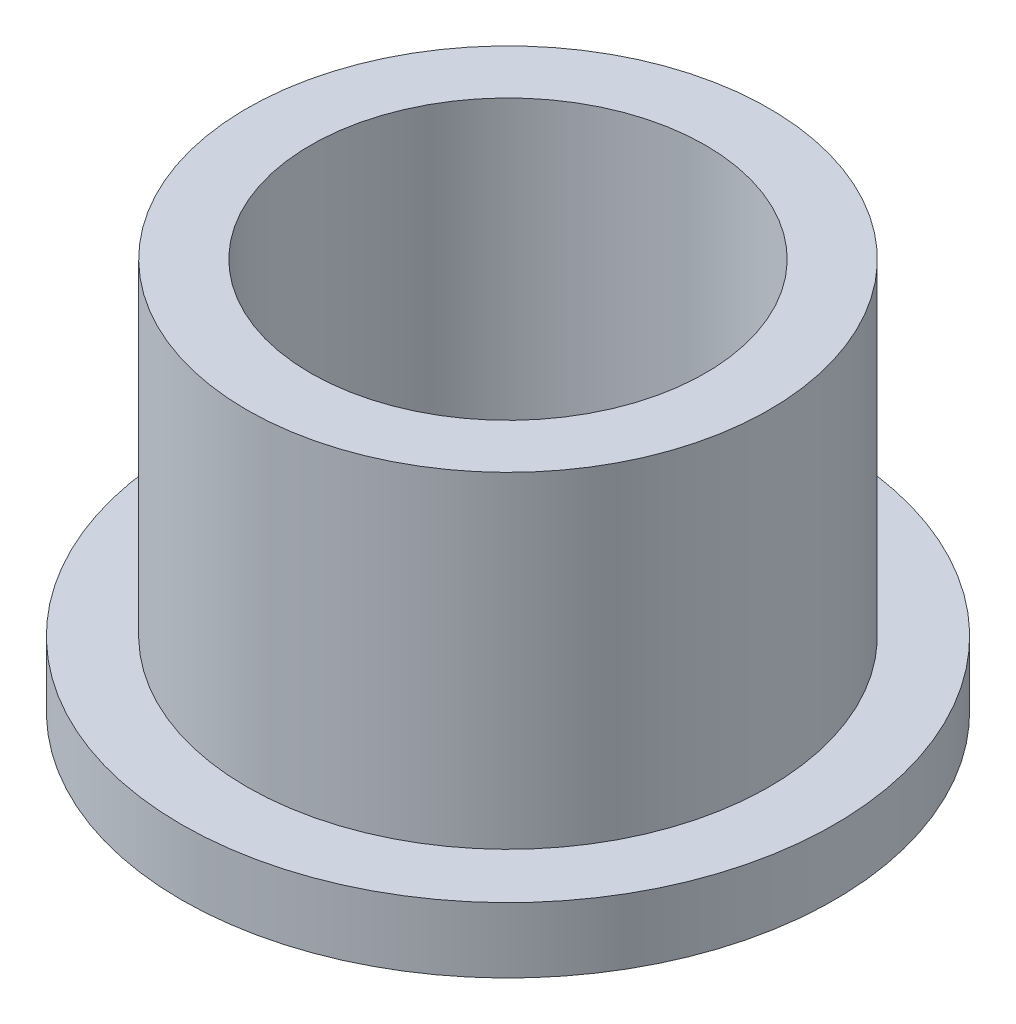
ISO-10303-21;
HEADER;
FILE_DESCRIPTION(('STEP AP214'),'2;1');
FILE_NAME('part.step','',(''),(''),'','','');
FILE_SCHEMA(('AUTOMOTIVE_DESIGN { 1 0 10303 214 1 1 1 1 }'));
ENDSEC;
DATA;
#1=APPLICATION_CONTEXT('core data for automotive mechanical design processes');
#2=APPLICATION_PROTOCOL_DEFINITION('international standard','automotive_design',2000,#1);
#3=PRODUCT_CONTEXT('',#1,'mechanical');
#4=PRODUCT('Part','Part','',(#3));
#5=PRODUCT_RELATED_PRODUCT_CATEGORY('part','',(#4));
#6=PRODUCT_DEFINITION_FORMATION('','',#4);
#7=PRODUCT_DEFINITION_CONTEXT('part definition',#1,'design');
#8=PRODUCT_DEFINITION('design','',#6,#7);
#9=PRODUCT_DEFINITION_SHAPE('','',#8);
#10=(LENGTH_UNIT() NAMED_UNIT(*) SI_UNIT(.MILLI.,.METRE.));
#11=(NAMED_UNIT(*) PLANE_ANGLE_UNIT() SI_UNIT($,.RADIAN.));
#12=(NAMED_UNIT(*) SI_UNIT($,.STERADIAN.) SOLID_ANGLE_UNIT());
#13=UNCERTAINTY_MEASURE_WITH_UNIT(LENGTH_MEASURE(1.E-05),#10,'distance_accuracy_value','');
#14=(GEOMETRIC_REPRESENTATION_CONTEXT(3) GLOBAL_UNCERTAINTY_ASSIGNED_CONTEXT((#13)) GLOBAL_UNIT_ASSIGNED_CONTEXT((#10,
#11,#12)) REPRESENTATION_CONTEXT('',''));
#15=CARTESIAN_POINT('',(0.,0.,0.));
#16=DIRECTION('',(0.,0.,1.));
#17=DIRECTION('',(1.,0.,0.));
#18=AXIS2_PLACEMENT_3D('',#15,#16,#17);
#19=CARTESIAN_POINT('',(0.,9.525,0.));
#20=DIRECTION('',(0.,1.,0.));
#21=DIRECTION('',(0.,0.,1.));
#22=AXIS2_PLACEMENT_3D('',#19,#20,#21);
#23=PLANE('',#22);
#24=CARTESIAN_POINT('',(0.,9.525,0.));
#25=DIRECTION('',(0.,1.,0.));
#26=DIRECTION('',(0.,0.,1.));
#27=AXIS2_PLACEMENT_3D('',#24,#25,#26);
#28=CIRCLE('',#27,6.35);
#29=CARTESIAN_POINT('',(0.,9.525,6.35));
#30=VERTEX_POINT('',#29);
#31=EDGE_CURVE('E10',#30,#30,#28,.T.);
#32=ORIENTED_EDGE('',*,*,#31,.T.);
#33=EDGE_LOOP('',(#32));
#34=FACE_BOUND('',#33,.T.);
#35=CARTESIAN_POINT('',(0.,9.525,0.));
#36=DIRECTION('',(0.,1.,0.));
#37=DIRECTION('',(0.,0.,1.));
#38=AXIS2_PLACEMENT_3D('',#35,#36,#37);
#39=CIRCLE('',#38,4.8006);
#40=CARTESIAN_POINT('',(0.,9.525,4.8006));
#41=VERTEX_POINT('',#40);
#42=EDGE_CURVE('E37',#41,#41,#39,.T.);
#43=ORIENTED_EDGE('',*,*,#42,.F.);
#44=EDGE_LOOP('',(#43));
#45=FACE_BOUND('',#44,.T.);
#46=ADVANCED_FACE('F30',(#34,#45),#23,.T.);
#47=CARTESIAN_POINT('',(0.,0.,0.));
#48=DIRECTION('',(0.,1.,0.));
#49=DIRECTION('',(0.,0.,1.));
#50=AXIS2_PLACEMENT_3D('',#47,#48,#49);
#51=PLANE('',#50);
#52=CARTESIAN_POINT('',(0.,0.,0.));
#53=DIRECTION('',(0.,1.,0.));
#54=DIRECTION('',(0.,0.,1.));
#55=AXIS2_PLACEMENT_3D('',#52,#53,#54);
#56=CIRCLE('',#55,4.8006);
#57=CARTESIAN_POINT('',(0.,0.,4.8006));
#58=VERTEX_POINT('',#57);
#59=EDGE_CURVE('E41',#58,#58,#56,.T.);
#60=ORIENTED_EDGE('',*,*,#59,.T.);
#61=EDGE_LOOP('',(#60));
#62=FACE_BOUND('',#61,.T.);
#63=CARTESIAN_POINT('',(0.,0.,0.));
#64=DIRECTION('',(0.,1.,0.));
#65=DIRECTION('',(0.,0.,1.));
#66=AXIS2_PLACEMENT_3D('',#63,#64,#65);
#67=CIRCLE('',#66,7.9375);
#68=CARTESIAN_POINT('',(0.,0.,7.9375));
#69=VERTEX_POINT('',#68);
#70=EDGE_CURVE('E48',#69,#69,#67,.T.);
#71=ORIENTED_EDGE('',*,*,#70,.F.);
#72=EDGE_LOOP('',(#71));
#73=FACE_BOUND('',#72,.T.);
#74=ADVANCED_FACE('F73',(#62,#73),#51,.F.);
#75=CARTESIAN_POINT('',(0.,9.525,0.));
#76=DIRECTION('',(0.,-1.,0.));
#77=DIRECTION('',(0.,0.,-1.));
#78=AXIS2_PLACEMENT_3D('',#75,#76,#77);
#79=CYLINDRICAL_SURFACE('',#78,6.35);
#80=CARTESIAN_POINT('',(0.,1.5875,0.));
#81=DIRECTION('',(0.,1.,0.));
#82=DIRECTION('',(0.,0.,1.));
#83=AXIS2_PLACEMENT_3D('',#80,#81,#82);
#84=CIRCLE('',#83,6.35);
#85=CARTESIAN_POINT('',(0.,1.5875,6.35));
#86=VERTEX_POINT('',#85);
#87=EDGE_CURVE('E51',#86,#86,#84,.T.);
#88=ORIENTED_EDGE('',*,*,#87,.T.);
#89=EDGE_LOOP('',(#88));
#90=FACE_BOUND('',#89,.T.);
#91=ORIENTED_EDGE('',*,*,#31,.F.);
#92=EDGE_LOOP('',(#91));
#93=FACE_BOUND('',#92,.T.);
#94=ADVANCED_FACE('F32',(#90,#93),#79,.T.);
#95=CARTESIAN_POINT('',(0.,9.525,0.));
#96=DIRECTION('',(0.,-1.,0.));
#97=DIRECTION('',(0.,0.,-1.));
#98=AXIS2_PLACEMENT_3D('',#95,#96,#97);
#99=CYLINDRICAL_SURFACE('',#98,4.8006);
#100=ORIENTED_EDGE('',*,*,#42,.T.);
#101=EDGE_LOOP('',(#100));
#102=FACE_BOUND('',#101,.T.);
#103=ORIENTED_EDGE('',*,*,#59,.F.);
#104=EDGE_LOOP('',(#103));
#105=FACE_BOUND('',#104,.T.);
#106=ADVANCED_FACE('F62',(#102,#105),#99,.F.);
#107=CARTESIAN_POINT('',(0.,1.5875,0.));
#108=DIRECTION('',(0.,1.,0.));
#109=DIRECTION('',(0.,0.,1.));
#110=AXIS2_PLACEMENT_3D('',#107,#108,#109);
#111=PLANE('',#110);
#112=CARTESIAN_POINT('',(0.,1.5875,0.));
#113=DIRECTION('',(0.,1.,0.));
#114=DIRECTION('',(0.,0.,1.));
#115=AXIS2_PLACEMENT_3D('',#112,#113,#114);
#116=CIRCLE('',#115,7.9375);
#117=CARTESIAN_POINT('',(0.,1.5875,7.9375));
#118=VERTEX_POINT('',#117);
#119=EDGE_CURVE('E46',#118,#118,#116,.T.);
#120=ORIENTED_EDGE('',*,*,#119,.T.);
#121=EDGE_LOOP('',(#120));
#122=FACE_BOUND('',#121,.T.);
#123=ORIENTED_EDGE('',*,*,#87,.F.);
#124=EDGE_LOOP('',(#123));
#125=FACE_BOUND('',#124,.T.);
#126=ADVANCED_FACE('F59',(#122,#125),#111,.T.);
#127=CARTESIAN_POINT('',(0.,1.5875,0.));
#128=DIRECTION('',(0.,-1.,0.));
#129=DIRECTION('',(0.,0.,-1.));
#130=AXIS2_PLACEMENT_3D('',#127,#128,#129);
#131=CYLINDRICAL_SURFACE('',#130,7.9375);
#132=ORIENTED_EDGE('',*,*,#119,.F.);
#133=EDGE_LOOP('',(#132));
#134=FACE_BOUND('',#133,.T.);
#135=ORIENTED_EDGE('',*,*,#70,.T.);
#136=EDGE_LOOP('',(#135));
#137=FACE_BOUND('',#136,.T.);
#138=ADVANCED_FACE('F61',(#134,#137),#131,.T.);
#139=CLOSED_SHELL('',(#46,#74,#94,#106,#126,#138));
#140=MANIFOLD_SOLID_BREP('B2',#139);
#141=ADVANCED_BREP_SHAPE_REPRESENTATION('',(#18,#140),#14);
#142=SHAPE_DEFINITION_REPRESENTATION(#9,#141);
ENDSEC;
END-ISO-10303-21;
